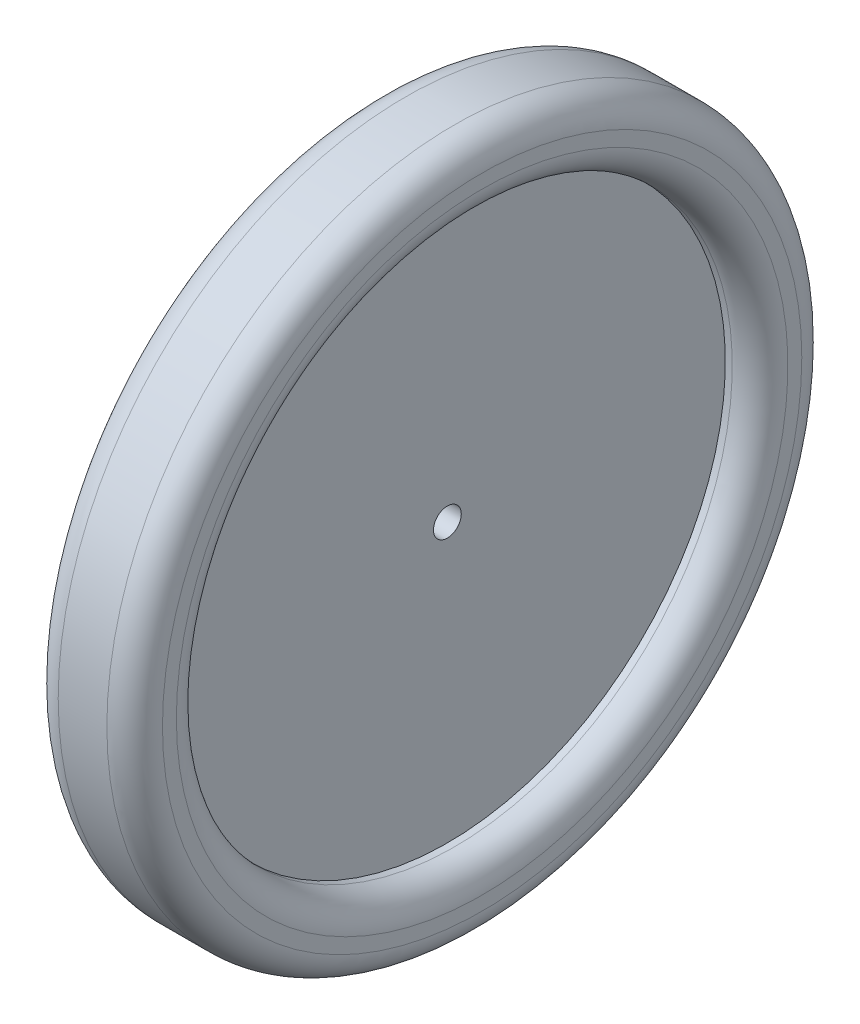
ISO-10303-21;
HEADER;
FILE_DESCRIPTION(('STEP AP214'),'2;1');
FILE_NAME('part.step','',(''),(''),'','','');
FILE_SCHEMA(('AUTOMOTIVE_DESIGN { 1 0 10303 214 1 1 1 1 }'));
ENDSEC;
DATA;
#1=APPLICATION_CONTEXT('core data for automotive mechanical design processes');
#2=APPLICATION_PROTOCOL_DEFINITION('international standard','automotive_design',2000,#1);
#3=PRODUCT_CONTEXT('',#1,'mechanical');
#4=PRODUCT('Part','Part','',(#3));
#5=PRODUCT_RELATED_PRODUCT_CATEGORY('part','',(#4));
#6=PRODUCT_DEFINITION_FORMATION('','',#4);
#7=PRODUCT_DEFINITION_CONTEXT('part definition',#1,'design');
#8=PRODUCT_DEFINITION('design','',#6,#7);
#9=PRODUCT_DEFINITION_SHAPE('','',#8);
#10=(LENGTH_UNIT() NAMED_UNIT(*) SI_UNIT(.MILLI.,.METRE.));
#11=(NAMED_UNIT(*) PLANE_ANGLE_UNIT() SI_UNIT($,.RADIAN.));
#12=(NAMED_UNIT(*) SI_UNIT($,.STERADIAN.) SOLID_ANGLE_UNIT());
#13=UNCERTAINTY_MEASURE_WITH_UNIT(LENGTH_MEASURE(1.E-05),#10,'distance_accuracy_value','');
#14=(GEOMETRIC_REPRESENTATION_CONTEXT(3) GLOBAL_UNCERTAINTY_ASSIGNED_CONTEXT((#13)) GLOBAL_UNIT_ASSIGNED_CONTEXT((#10,
#11,#12)) REPRESENTATION_CONTEXT('',''));
#15=CARTESIAN_POINT('',(0.,0.,0.));
#16=DIRECTION('',(0.,0.,1.));
#17=DIRECTION('',(1.,0.,0.));
#18=AXIS2_PLACEMENT_3D('',#15,#16,#17);
#19=CARTESIAN_POINT('',(-0.635000000000001,10.16,0.));
#20=DIRECTION('',(1.,0.,0.));
#21=DIRECTION('',(0.,0.,-1.));
#22=AXIS2_PLACEMENT_3D('',#19,#20,#21);
#23=PLANE('',#22);
#24=CARTESIAN_POINT('',(-0.635000000000001,0.,0.));
#25=DIRECTION('',(1.,0.,0.));
#26=DIRECTION('',(0.,0.,-1.));
#27=AXIS2_PLACEMENT_3D('',#24,#25,#26);
#28=CIRCLE('',#27,0.508);
#29=CARTESIAN_POINT('',(-0.635000000000001,0.,-0.508));
#30=VERTEX_POINT('',#29);
#31=EDGE_CURVE('E83',#30,#30,#28,.T.);
#32=ORIENTED_EDGE('',*,*,#31,.T.);
#33=EDGE_LOOP('',(#32));
#34=FACE_BOUND('',#33,.T.);
#35=CARTESIAN_POINT('',(-0.635000000000001,0.,0.));
#36=DIRECTION('',(-1.,0.,0.));
#37=DIRECTION('',(0.,0.,1.));
#38=AXIS2_PLACEMENT_3D('',#35,#36,#37);
#39=CIRCLE('',#38,10.16);
#40=CARTESIAN_POINT('',(-0.635000000000001,0.,10.16));
#41=VERTEX_POINT('',#40);
#42=EDGE_CURVE('E10',#41,#41,#39,.T.);
#43=ORIENTED_EDGE('',*,*,#42,.T.);
#44=EDGE_LOOP('',(#43));
#45=FACE_BOUND('',#44,.T.);
#46=ADVANCED_FACE('F36',(#34,#45),#23,.F.);
#47=CARTESIAN_POINT('',(-0.635,0.,0.));
#48=DIRECTION('',(-1.,0.,0.));
#49=DIRECTION('',(0.,0.,1.));
#50=AXIS2_PLACEMENT_3D('',#47,#48,#49);
#51=CYLINDRICAL_SURFACE('',#50,10.16);
#52=ORIENTED_EDGE('',*,*,#42,.F.);
#53=EDGE_LOOP('',(#52));
#54=FACE_BOUND('',#53,.T.);
#55=CARTESIAN_POINT('',(-0.888999999999993,0.,0.));
#56=DIRECTION('',(-1.,0.,0.));
#57=DIRECTION('',(0.,0.,1.));
#58=AXIS2_PLACEMENT_3D('',#55,#56,#57);
#59=CIRCLE('',#58,10.16);
#60=CARTESIAN_POINT('',(-0.888999999999993,0.,10.16));
#61=VERTEX_POINT('',#60);
#62=EDGE_CURVE('E43',#61,#61,#59,.T.);
#63=ORIENTED_EDGE('',*,*,#62,.T.);
#64=EDGE_LOOP('',(#63));
#65=FACE_BOUND('',#64,.T.);
#66=ADVANCED_FACE('F114',(#54,#65),#51,.F.);
#67=CARTESIAN_POINT('',(-0.889,0.,0.));
#68=DIRECTION('',(-1.,0.,0.));
#69=DIRECTION('',(0.,0.,1.));
#70=AXIS2_PLACEMENT_3D('',#67,#68,#69);
#71=TOROIDAL_SURFACE('',#70,11.176,1.016);
#72=ORIENTED_EDGE('',*,*,#62,.F.);
#73=EDGE_LOOP('',(#72));
#74=FACE_BOUND('',#73,.T.);
#75=CARTESIAN_POINT('',(-1.905,0.,0.));
#76=DIRECTION('',(-1.,0.,0.));
#77=DIRECTION('',(0.,0.,1.));
#78=AXIS2_PLACEMENT_3D('',#75,#76,#77);
#79=CIRCLE('',#78,11.176);
#80=CARTESIAN_POINT('',(-1.905,0.,11.176));
#81=VERTEX_POINT('',#80);
#82=EDGE_CURVE('E48',#81,#81,#79,.T.);
#83=ORIENTED_EDGE('',*,*,#82,.T.);
#84=EDGE_LOOP('',(#83));
#85=FACE_BOUND('',#84,.T.);
#86=ADVANCED_FACE('F119',(#74,#85),#71,.T.);
#87=CARTESIAN_POINT('',(-1.905,11.684,0.));
#88=DIRECTION('',(1.,0.,0.));
#89=DIRECTION('',(0.,0.,-1.));
#90=AXIS2_PLACEMENT_3D('',#87,#88,#89);
#91=PLANE('',#90);
#92=ORIENTED_EDGE('',*,*,#82,.F.);
#93=EDGE_LOOP('',(#92));
#94=FACE_BOUND('',#93,.T.);
#95=CARTESIAN_POINT('',(-1.905,0.,0.));
#96=DIRECTION('',(-1.,0.,0.));
#97=DIRECTION('',(0.,0.,1.));
#98=AXIS2_PLACEMENT_3D('',#95,#96,#97);
#99=CIRCLE('',#98,11.684);
#100=CARTESIAN_POINT('',(-1.905,0.,11.684));
#101=VERTEX_POINT('',#100);
#102=EDGE_CURVE('E53',#101,#101,#99,.T.);
#103=ORIENTED_EDGE('',*,*,#102,.T.);
#104=EDGE_LOOP('',(#103));
#105=FACE_BOUND('',#104,.T.);
#106=ADVANCED_FACE('F184',(#94,#105),#91,.F.);
#107=CARTESIAN_POINT('',(-0.889000000000001,0.,0.));
#108=DIRECTION('',(-1.,0.,0.));
#109=DIRECTION('',(0.,0.,1.));
#110=AXIS2_PLACEMENT_3D('',#107,#108,#109);
#111=TOROIDAL_SURFACE('',#110,11.684,1.016);
#112=ORIENTED_EDGE('',*,*,#102,.F.);
#113=EDGE_LOOP('',(#112));
#114=FACE_BOUND('',#113,.T.);
#115=CARTESIAN_POINT('',(-0.888999999999994,0.,0.));
#116=DIRECTION('',(-1.,0.,0.));
#117=DIRECTION('',(0.,0.,1.));
#118=AXIS2_PLACEMENT_3D('',#115,#116,#117);
#119=CIRCLE('',#118,12.7);
#120=CARTESIAN_POINT('',(-0.888999999999994,0.,12.7));
#121=VERTEX_POINT('',#120);
#122=EDGE_CURVE('E59',#121,#121,#119,.T.);
#123=ORIENTED_EDGE('',*,*,#122,.T.);
#124=EDGE_LOOP('',(#123));
#125=FACE_BOUND('',#124,.T.);
#126=ADVANCED_FACE('F174',(#114,#125),#111,.T.);
#127=CARTESIAN_POINT('',(-0.635,0.,0.));
#128=DIRECTION('',(-1.,0.,0.));
#129=DIRECTION('',(0.,0.,1.));
#130=AXIS2_PLACEMENT_3D('',#127,#128,#129);
#131=CYLINDRICAL_SURFACE('',#130,12.7);
#132=ORIENTED_EDGE('',*,*,#122,.F.);
#133=EDGE_LOOP('',(#132));
#134=FACE_BOUND('',#133,.T.);
#135=CARTESIAN_POINT('',(0.888999999999994,0.,0.));
#136=DIRECTION('',(-1.,0.,0.));
#137=DIRECTION('',(0.,0.,1.));
#138=AXIS2_PLACEMENT_3D('',#135,#136,#137);
#139=CIRCLE('',#138,12.7);
#140=CARTESIAN_POINT('',(0.888999999999994,0.,12.7));
#141=VERTEX_POINT('',#140);
#142=EDGE_CURVE('E63',#141,#141,#139,.T.);
#143=ORIENTED_EDGE('',*,*,#142,.T.);
#144=EDGE_LOOP('',(#143));
#145=FACE_BOUND('',#144,.T.);
#146=ADVANCED_FACE('F164',(#134,#145),#131,.T.);
#147=CARTESIAN_POINT('',(0.889000000000001,0.,0.));
#148=DIRECTION('',(-1.,0.,0.));
#149=DIRECTION('',(0.,0.,1.));
#150=AXIS2_PLACEMENT_3D('',#147,#148,#149);
#151=TOROIDAL_SURFACE('',#150,11.684,1.016);
#152=ORIENTED_EDGE('',*,*,#142,.F.);
#153=EDGE_LOOP('',(#152));
#154=FACE_BOUND('',#153,.T.);
#155=CARTESIAN_POINT('',(1.905,0.,0.));
#156=DIRECTION('',(-1.,0.,0.));
#157=DIRECTION('',(0.,0.,1.));
#158=AXIS2_PLACEMENT_3D('',#155,#156,#157);
#159=CIRCLE('',#158,11.684);
#160=CARTESIAN_POINT('',(1.905,0.,11.684));
#161=VERTEX_POINT('',#160);
#162=EDGE_CURVE('E67',#161,#161,#159,.T.);
#163=ORIENTED_EDGE('',*,*,#162,.T.);
#164=EDGE_LOOP('',(#163));
#165=FACE_BOUND('',#164,.T.);
#166=ADVANCED_FACE('F154',(#154,#165),#151,.T.);
#167=CARTESIAN_POINT('',(1.905,11.684,0.));
#168=DIRECTION('',(-1.,0.,0.));
#169=DIRECTION('',(0.,0.,1.));
#170=AXIS2_PLACEMENT_3D('',#167,#168,#169);
#171=PLANE('',#170);
#172=ORIENTED_EDGE('',*,*,#162,.F.);
#173=EDGE_LOOP('',(#172));
#174=FACE_BOUND('',#173,.T.);
#175=CARTESIAN_POINT('',(1.905,0.,0.));
#176=DIRECTION('',(-1.,0.,0.));
#177=DIRECTION('',(0.,0.,1.));
#178=AXIS2_PLACEMENT_3D('',#175,#176,#177);
#179=CIRCLE('',#178,11.176);
#180=CARTESIAN_POINT('',(1.905,0.,11.176));
#181=VERTEX_POINT('',#180);
#182=EDGE_CURVE('E71',#181,#181,#179,.T.);
#183=ORIENTED_EDGE('',*,*,#182,.T.);
#184=EDGE_LOOP('',(#183));
#185=FACE_BOUND('',#184,.T.);
#186=ADVANCED_FACE('F109',(#174,#185),#171,.F.);
#187=CARTESIAN_POINT('',(0.889,0.,0.));
#188=DIRECTION('',(-1.,0.,0.));
#189=DIRECTION('',(0.,0.,1.));
#190=AXIS2_PLACEMENT_3D('',#187,#188,#189);
#191=TOROIDAL_SURFACE('',#190,11.176,1.016);
#192=ORIENTED_EDGE('',*,*,#182,.F.);
#193=EDGE_LOOP('',(#192));
#194=FACE_BOUND('',#193,.T.);
#195=CARTESIAN_POINT('',(0.888999999999993,0.,0.));
#196=DIRECTION('',(-1.,0.,0.));
#197=DIRECTION('',(0.,0.,1.));
#198=AXIS2_PLACEMENT_3D('',#195,#196,#197);
#199=CIRCLE('',#198,10.16);
#200=CARTESIAN_POINT('',(0.888999999999993,0.,10.16));
#201=VERTEX_POINT('',#200);
#202=EDGE_CURVE('E75',#201,#201,#199,.T.);
#203=ORIENTED_EDGE('',*,*,#202,.T.);
#204=EDGE_LOOP('',(#203));
#205=FACE_BOUND('',#204,.T.);
#206=ADVANCED_FACE('F103',(#194,#205),#191,.T.);
#207=CARTESIAN_POINT('',(-0.635,0.,0.));
#208=DIRECTION('',(-1.,0.,0.));
#209=DIRECTION('',(0.,0.,1.));
#210=AXIS2_PLACEMENT_3D('',#207,#208,#209);
#211=CYLINDRICAL_SURFACE('',#210,10.16);
#212=ORIENTED_EDGE('',*,*,#202,.F.);
#213=EDGE_LOOP('',(#212));
#214=FACE_BOUND('',#213,.T.);
#215=CARTESIAN_POINT('',(0.635000000000001,0.,0.));
#216=DIRECTION('',(-1.,0.,0.));
#217=DIRECTION('',(0.,0.,1.));
#218=AXIS2_PLACEMENT_3D('',#215,#216,#217);
#219=CIRCLE('',#218,10.16);
#220=CARTESIAN_POINT('',(0.635000000000001,0.,10.16));
#221=VERTEX_POINT('',#220);
#222=EDGE_CURVE('E79',#221,#221,#219,.T.);
#223=ORIENTED_EDGE('',*,*,#222,.T.);
#224=EDGE_LOOP('',(#223));
#225=FACE_BOUND('',#224,.T.);
#226=ADVANCED_FACE('F98',(#214,#225),#211,.F.);
#227=CARTESIAN_POINT('',(0.635000000000001,10.16,0.));
#228=DIRECTION('',(-1.,0.,0.));
#229=DIRECTION('',(0.,0.,1.));
#230=AXIS2_PLACEMENT_3D('',#227,#228,#229);
#231=PLANE('',#230);
#232=CARTESIAN_POINT('',(0.635000000000001,0.,0.));
#233=DIRECTION('',(1.,0.,0.));
#234=DIRECTION('',(0.,0.,-1.));
#235=AXIS2_PLACEMENT_3D('',#232,#233,#234);
#236=CIRCLE('',#235,0.508);
#237=CARTESIAN_POINT('',(0.635000000000001,0.,-0.508));
#238=VERTEX_POINT('',#237);
#239=EDGE_CURVE('E87',#238,#238,#236,.T.);
#240=ORIENTED_EDGE('',*,*,#239,.F.);
#241=EDGE_LOOP('',(#240));
#242=FACE_BOUND('',#241,.T.);
#243=ORIENTED_EDGE('',*,*,#222,.F.);
#244=EDGE_LOOP('',(#243));
#245=FACE_BOUND('',#244,.T.);
#246=ADVANCED_FACE('F95',(#242,#245),#231,.F.);
#247=CARTESIAN_POINT('',(-1.905,0.,0.));
#248=DIRECTION('',(1.,0.,0.));
#249=DIRECTION('',(0.,0.,-1.));
#250=AXIS2_PLACEMENT_3D('',#247,#248,#249);
#251=CYLINDRICAL_SURFACE('',#250,0.508);
#252=ORIENTED_EDGE('',*,*,#239,.T.);
#253=EDGE_LOOP('',(#252));
#254=FACE_BOUND('',#253,.T.);
#255=ORIENTED_EDGE('',*,*,#31,.F.);
#256=EDGE_LOOP('',(#255));
#257=FACE_BOUND('',#256,.T.);
#258=ADVANCED_FACE('F92',(#254,#257),#251,.F.);
#259=CLOSED_SHELL('',(#46,#66,#86,#106,#126,#146,#166,#186,#206,#226,#246,#258));
#260=MANIFOLD_SOLID_BREP('B2',#259);
#261=ADVANCED_BREP_SHAPE_REPRESENTATION('',(#18,#260),#14);
#262=SHAPE_DEFINITION_REPRESENTATION(#9,#261);
ENDSEC;
END-ISO-10303-21;
